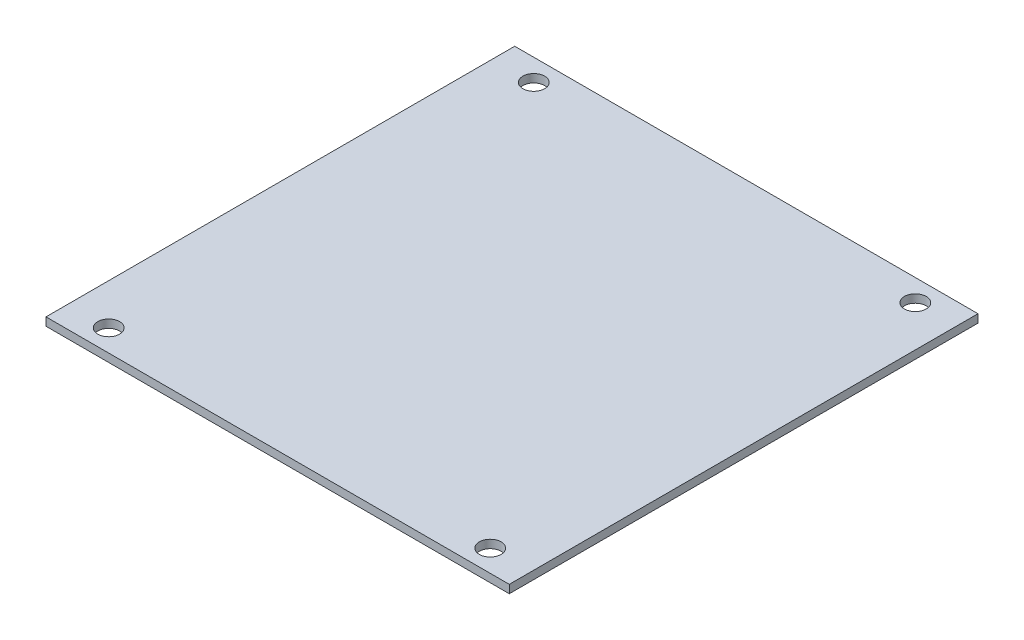
ISO-10303-21;
HEADER;
FILE_DESCRIPTION(('STEP AP214'),'2;1');
FILE_NAME('part.step','',(''),(''),'','','');
FILE_SCHEMA(('AUTOMOTIVE_DESIGN { 1 0 10303 214 1 1 1 1 }'));
ENDSEC;
DATA;
#1=APPLICATION_CONTEXT('core data for automotive mechanical design processes');
#2=APPLICATION_PROTOCOL_DEFINITION('international standard','automotive_design',2000,#1);
#3=PRODUCT_CONTEXT('',#1,'mechanical');
#4=PRODUCT('Part','Part','',(#3));
#5=PRODUCT_RELATED_PRODUCT_CATEGORY('part','',(#4));
#6=PRODUCT_DEFINITION_FORMATION('','',#4);
#7=PRODUCT_DEFINITION_CONTEXT('part definition',#1,'design');
#8=PRODUCT_DEFINITION('design','',#6,#7);
#9=PRODUCT_DEFINITION_SHAPE('','',#8);
#10=(LENGTH_UNIT() NAMED_UNIT(*) SI_UNIT(.MILLI.,.METRE.));
#11=(NAMED_UNIT(*) PLANE_ANGLE_UNIT() SI_UNIT($,.RADIAN.));
#12=(NAMED_UNIT(*) SI_UNIT($,.STERADIAN.) SOLID_ANGLE_UNIT());
#13=UNCERTAINTY_MEASURE_WITH_UNIT(LENGTH_MEASURE(1.E-05),#10,'distance_accuracy_value','');
#14=(GEOMETRIC_REPRESENTATION_CONTEXT(3) GLOBAL_UNCERTAINTY_ASSIGNED_CONTEXT((#13)) GLOBAL_UNIT_ASSIGNED_CONTEXT((#10,
#11,#12)) REPRESENTATION_CONTEXT('',''));
#15=CARTESIAN_POINT('',(0.,0.,0.));
#16=DIRECTION('',(0.,0.,1.));
#17=DIRECTION('',(1.,0.,0.));
#18=AXIS2_PLACEMENT_3D('',#15,#16,#17);
#19=CARTESIAN_POINT('',(0.,3.,0.));
#20=DIRECTION('',(0.,-1.,0.));
#21=DIRECTION('',(0.,0.,-1.));
#22=AXIS2_PLACEMENT_3D('',#19,#20,#21);
#23=PLANE('',#22);
#24=DIRECTION('',(0.,0.,-1.));
#25=VECTOR('',#24,1.);
#26=CARTESIAN_POINT('',(85.,3.,86.));
#27=LINE('',#26,#25);
#28=CARTESIAN_POINT('',(85.,3.,86.));
#29=VERTEX_POINT('',#28);
#30=CARTESIAN_POINT('',(85.,3.,-86.));
#31=VERTEX_POINT('',#30);
#32=EDGE_CURVE('E92',#29,#31,#27,.T.);
#33=ORIENTED_EDGE('',*,*,#32,.T.);
#34=DIRECTION('',(-1.,0.,0.));
#35=VECTOR('',#34,1.);
#36=CARTESIAN_POINT('',(-85.,3.,-86.));
#37=LINE('',#36,#35);
#38=CARTESIAN_POINT('',(-85.,3.,-86.));
#39=VERTEX_POINT('',#38);
#40=EDGE_CURVE('E87',#31,#39,#37,.T.);
#41=ORIENTED_EDGE('',*,*,#40,.T.);
#42=DIRECTION('',(0.,0.,1.));
#43=VECTOR('',#42,1.);
#44=CARTESIAN_POINT('',(-85.,3.,86.));
#45=LINE('',#44,#43);
#46=CARTESIAN_POINT('',(-85.,3.,86.));
#47=VERTEX_POINT('',#46);
#48=EDGE_CURVE('E90',#39,#47,#45,.T.);
#49=ORIENTED_EDGE('',*,*,#48,.T.);
#50=DIRECTION('',(1.,0.,0.));
#51=VECTOR('',#50,1.);
#52=CARTESIAN_POINT('',(-85.,3.,86.));
#53=LINE('',#52,#51);
#54=EDGE_CURVE('E57',#47,#29,#53,.T.);
#55=ORIENTED_EDGE('',*,*,#54,.T.);
#56=EDGE_LOOP('',(#33,#41,#49,#55));
#57=FACE_BOUND('',#56,.T.);
#58=CARTESIAN_POINT('',(-70.,3.,-78.));
#59=DIRECTION('',(0.,1.,0.));
#60=DIRECTION('',(0.,0.,1.));
#61=AXIS2_PLACEMENT_3D('',#58,#59,#60);
#62=CIRCLE('',#61,4.00000000000001);
#63=CARTESIAN_POINT('',(-70.,3.,-74.));
#64=VERTEX_POINT('',#63);
#65=EDGE_CURVE('E112',#64,#64,#62,.T.);
#66=ORIENTED_EDGE('',*,*,#65,.F.);
#67=EDGE_LOOP('',(#66));
#68=FACE_BOUND('',#67,.T.);
#69=CARTESIAN_POINT('',(70.,3.,-78.));
#70=DIRECTION('',(0.,1.,0.));
#71=DIRECTION('',(0.,0.,-1.));
#72=AXIS2_PLACEMENT_3D('',#69,#70,#71);
#73=CIRCLE('',#72,4.00000000000001);
#74=CARTESIAN_POINT('',(70.,3.,-82.));
#75=VERTEX_POINT('',#74);
#76=EDGE_CURVE('E134',#75,#75,#73,.T.);
#77=ORIENTED_EDGE('',*,*,#76,.F.);
#78=EDGE_LOOP('',(#77));
#79=FACE_BOUND('',#78,.T.);
#80=CARTESIAN_POINT('',(70.,3.,78.));
#81=DIRECTION('',(0.,1.,0.));
#82=DIRECTION('',(0.,0.,1.));
#83=AXIS2_PLACEMENT_3D('',#80,#81,#82);
#84=CIRCLE('',#83,4.00000000000001);
#85=CARTESIAN_POINT('',(70.,3.,82.));
#86=VERTEX_POINT('',#85);
#87=EDGE_CURVE('E142',#86,#86,#84,.T.);
#88=ORIENTED_EDGE('',*,*,#87,.F.);
#89=EDGE_LOOP('',(#88));
#90=FACE_BOUND('',#89,.T.);
#91=CARTESIAN_POINT('',(-70.,3.,78.));
#92=DIRECTION('',(0.,1.,0.));
#93=DIRECTION('',(0.,0.,-1.));
#94=AXIS2_PLACEMENT_3D('',#91,#92,#93);
#95=CIRCLE('',#94,4.00000000000001);
#96=CARTESIAN_POINT('',(-70.,3.,74.));
#97=VERTEX_POINT('',#96);
#98=EDGE_CURVE('E150',#97,#97,#95,.T.);
#99=ORIENTED_EDGE('',*,*,#98,.F.);
#100=EDGE_LOOP('',(#99));
#101=FACE_BOUND('',#100,.T.);
#102=ADVANCED_FACE('F39',(#57,#68,#79,#90,#101),#23,.F.);
#103=CARTESIAN_POINT('',(0.,0.,0.));
#104=DIRECTION('',(0.,-1.,0.));
#105=DIRECTION('',(0.,0.,-1.));
#106=AXIS2_PLACEMENT_3D('',#103,#104,#105);
#107=PLANE('',#106);
#108=CARTESIAN_POINT('',(70.,0.,78.));
#109=DIRECTION('',(0.,1.,0.));
#110=DIRECTION('',(0.,0.,1.));
#111=AXIS2_PLACEMENT_3D('',#108,#109,#110);
#112=CIRCLE('',#111,4.00000000000001);
#113=CARTESIAN_POINT('',(70.,0.,82.));
#114=VERTEX_POINT('',#113);
#115=EDGE_CURVE('E146',#114,#114,#112,.T.);
#116=ORIENTED_EDGE('',*,*,#115,.T.);
#117=EDGE_LOOP('',(#116));
#118=FACE_BOUND('',#117,.T.);
#119=CARTESIAN_POINT('',(-70.,0.,-78.));
#120=DIRECTION('',(0.,1.,0.));
#121=DIRECTION('',(0.,0.,1.));
#122=AXIS2_PLACEMENT_3D('',#119,#120,#121);
#123=CIRCLE('',#122,4.00000000000001);
#124=CARTESIAN_POINT('',(-70.,0.,-74.));
#125=VERTEX_POINT('',#124);
#126=EDGE_CURVE('E130',#125,#125,#123,.T.);
#127=ORIENTED_EDGE('',*,*,#126,.T.);
#128=EDGE_LOOP('',(#127));
#129=FACE_BOUND('',#128,.T.);
#130=DIRECTION('',(0.,0.,-1.));
#131=VECTOR('',#130,1.);
#132=CARTESIAN_POINT('',(85.,0.,86.));
#133=LINE('',#132,#131);
#134=CARTESIAN_POINT('',(85.,0.,86.));
#135=VERTEX_POINT('',#134);
#136=CARTESIAN_POINT('',(85.,0.,-86.));
#137=VERTEX_POINT('',#136);
#138=EDGE_CURVE('E108',#135,#137,#133,.T.);
#139=ORIENTED_EDGE('',*,*,#138,.F.);
#140=DIRECTION('',(1.,0.,0.));
#141=VECTOR('',#140,1.);
#142=CARTESIAN_POINT('',(-85.,0.,86.));
#143=LINE('',#142,#141);
#144=CARTESIAN_POINT('',(-85.,0.,86.));
#145=VERTEX_POINT('',#144);
#146=EDGE_CURVE('E80',#145,#135,#143,.T.);
#147=ORIENTED_EDGE('',*,*,#146,.F.);
#148=DIRECTION('',(0.,0.,1.));
#149=VECTOR('',#148,1.);
#150=CARTESIAN_POINT('',(-85.,0.,86.));
#151=LINE('',#150,#149);
#152=CARTESIAN_POINT('',(-85.,0.,-86.));
#153=VERTEX_POINT('',#152);
#154=EDGE_CURVE('E74',#153,#145,#151,.T.);
#155=ORIENTED_EDGE('',*,*,#154,.F.);
#156=DIRECTION('',(-1.,0.,0.));
#157=VECTOR('',#156,1.);
#158=CARTESIAN_POINT('',(-85.,0.,-86.));
#159=LINE('',#158,#157);
#160=EDGE_CURVE('E97',#137,#153,#159,.T.);
#161=ORIENTED_EDGE('',*,*,#160,.F.);
#162=EDGE_LOOP('',(#139,#147,#155,#161));
#163=FACE_BOUND('',#162,.T.);
#164=CARTESIAN_POINT('',(70.,0.,-78.));
#165=DIRECTION('',(0.,1.,0.));
#166=DIRECTION('',(0.,0.,-1.));
#167=AXIS2_PLACEMENT_3D('',#164,#165,#166);
#168=CIRCLE('',#167,4.00000000000001);
#169=CARTESIAN_POINT('',(70.,0.,-82.));
#170=VERTEX_POINT('',#169);
#171=EDGE_CURVE('E138',#170,#170,#168,.T.);
#172=ORIENTED_EDGE('',*,*,#171,.T.);
#173=EDGE_LOOP('',(#172));
#174=FACE_BOUND('',#173,.T.);
#175=CARTESIAN_POINT('',(-70.,0.,78.));
#176=DIRECTION('',(0.,1.,0.));
#177=DIRECTION('',(0.,0.,-1.));
#178=AXIS2_PLACEMENT_3D('',#175,#176,#177);
#179=CIRCLE('',#178,4.00000000000001);
#180=CARTESIAN_POINT('',(-70.,0.,74.));
#181=VERTEX_POINT('',#180);
#182=EDGE_CURVE('E154',#181,#181,#179,.T.);
#183=ORIENTED_EDGE('',*,*,#182,.T.);
#184=EDGE_LOOP('',(#183));
#185=FACE_BOUND('',#184,.T.);
#186=ADVANCED_FACE('F125',(#118,#129,#163,#174,#185),#107,.T.);
#187=CARTESIAN_POINT('',(85.,3.,86.));
#188=DIRECTION('',(-1.,0.,0.));
#189=DIRECTION('',(0.,0.,1.));
#190=AXIS2_PLACEMENT_3D('',#187,#188,#189);
#191=PLANE('',#190);
#192=ORIENTED_EDGE('',*,*,#138,.T.);
#193=DIRECTION('',(0.,-1.,0.));
#194=VECTOR('',#193,1.);
#195=CARTESIAN_POINT('',(85.,3.,-86.));
#196=LINE('',#195,#194);
#197=EDGE_CURVE('E11',#31,#137,#196,.T.);
#198=ORIENTED_EDGE('',*,*,#197,.F.);
#199=ORIENTED_EDGE('',*,*,#32,.F.);
#200=DIRECTION('',(0.,-1.,0.));
#201=VECTOR('',#200,1.);
#202=CARTESIAN_POINT('',(85.,3.,86.));
#203=LINE('',#202,#201);
#204=EDGE_CURVE('E104',#29,#135,#203,.T.);
#205=ORIENTED_EDGE('',*,*,#204,.T.);
#206=EDGE_LOOP('',(#192,#198,#199,#205));
#207=FACE_BOUND('',#206,.T.);
#208=ADVANCED_FACE('F41',(#207),#191,.F.);
#209=CARTESIAN_POINT('',(-85.,3.,-86.));
#210=DIRECTION('',(0.,0.,1.));
#211=DIRECTION('',(1.,0.,0.));
#212=AXIS2_PLACEMENT_3D('',#209,#210,#211);
#213=PLANE('',#212);
#214=ORIENTED_EDGE('',*,*,#160,.T.);
#215=DIRECTION('',(0.,-1.,0.));
#216=VECTOR('',#215,1.);
#217=CARTESIAN_POINT('',(-85.,3.,-86.));
#218=LINE('',#217,#216);
#219=EDGE_CURVE('E49',#39,#153,#218,.T.);
#220=ORIENTED_EDGE('',*,*,#219,.F.);
#221=ORIENTED_EDGE('',*,*,#40,.F.);
#222=ORIENTED_EDGE('',*,*,#197,.T.);
#223=EDGE_LOOP('',(#214,#220,#221,#222));
#224=FACE_BOUND('',#223,.T.);
#225=ADVANCED_FACE('F96',(#224),#213,.F.);
#226=CARTESIAN_POINT('',(-85.,3.,86.));
#227=DIRECTION('',(1.,0.,0.));
#228=DIRECTION('',(0.,0.,-1.));
#229=AXIS2_PLACEMENT_3D('',#226,#227,#228);
#230=PLANE('',#229);
#231=ORIENTED_EDGE('',*,*,#154,.T.);
#232=DIRECTION('',(0.,-1.,0.));
#233=VECTOR('',#232,1.);
#234=CARTESIAN_POINT('',(-85.,3.,86.));
#235=LINE('',#234,#233);
#236=EDGE_CURVE('E99',#47,#145,#235,.T.);
#237=ORIENTED_EDGE('',*,*,#236,.F.);
#238=ORIENTED_EDGE('',*,*,#48,.F.);
#239=ORIENTED_EDGE('',*,*,#219,.T.);
#240=EDGE_LOOP('',(#231,#237,#238,#239));
#241=FACE_BOUND('',#240,.T.);
#242=ADVANCED_FACE('F100',(#241),#230,.F.);
#243=CARTESIAN_POINT('',(-85.,3.,86.));
#244=DIRECTION('',(0.,0.,-1.));
#245=DIRECTION('',(-1.,0.,0.));
#246=AXIS2_PLACEMENT_3D('',#243,#244,#245);
#247=PLANE('',#246);
#248=ORIENTED_EDGE('',*,*,#146,.T.);
#249=ORIENTED_EDGE('',*,*,#204,.F.);
#250=ORIENTED_EDGE('',*,*,#54,.F.);
#251=ORIENTED_EDGE('',*,*,#236,.T.);
#252=EDGE_LOOP('',(#248,#249,#250,#251));
#253=FACE_BOUND('',#252,.T.);
#254=ADVANCED_FACE('F122',(#253),#247,.F.);
#255=CARTESIAN_POINT('',(-70.,3.,-78.));
#256=DIRECTION('',(0.,-1.,0.));
#257=DIRECTION('',(0.,0.,-1.));
#258=AXIS2_PLACEMENT_3D('',#255,#256,#257);
#259=CYLINDRICAL_SURFACE('',#258,4.00000000000001);
#260=ORIENTED_EDGE('',*,*,#65,.T.);
#261=EDGE_LOOP('',(#260));
#262=FACE_BOUND('',#261,.T.);
#263=ORIENTED_EDGE('',*,*,#126,.F.);
#264=EDGE_LOOP('',(#263));
#265=FACE_BOUND('',#264,.T.);
#266=ADVANCED_FACE('F173',(#262,#265),#259,.F.);
#267=CARTESIAN_POINT('',(70.,3.,-78.));
#268=DIRECTION('',(0.,-1.,0.));
#269=DIRECTION('',(0.,0.,-1.));
#270=AXIS2_PLACEMENT_3D('',#267,#268,#269);
#271=CYLINDRICAL_SURFACE('',#270,4.00000000000001);
#272=ORIENTED_EDGE('',*,*,#76,.T.);
#273=EDGE_LOOP('',(#272));
#274=FACE_BOUND('',#273,.T.);
#275=ORIENTED_EDGE('',*,*,#171,.F.);
#276=EDGE_LOOP('',(#275));
#277=FACE_BOUND('',#276,.T.);
#278=ADVANCED_FACE('F219',(#274,#277),#271,.F.);
#279=CARTESIAN_POINT('',(70.,3.,78.));
#280=DIRECTION('',(0.,-1.,0.));
#281=DIRECTION('',(0.,0.,-1.));
#282=AXIS2_PLACEMENT_3D('',#279,#280,#281);
#283=CYLINDRICAL_SURFACE('',#282,4.00000000000001);
#284=ORIENTED_EDGE('',*,*,#87,.T.);
#285=EDGE_LOOP('',(#284));
#286=FACE_BOUND('',#285,.T.);
#287=ORIENTED_EDGE('',*,*,#115,.F.);
#288=EDGE_LOOP('',(#287));
#289=FACE_BOUND('',#288,.T.);
#290=ADVANCED_FACE('F227',(#286,#289),#283,.F.);
#291=CARTESIAN_POINT('',(-70.,3.,78.));
#292=DIRECTION('',(0.,-1.,0.));
#293=DIRECTION('',(0.,0.,-1.));
#294=AXIS2_PLACEMENT_3D('',#291,#292,#293);
#295=CYLINDRICAL_SURFACE('',#294,4.00000000000001);
#296=ORIENTED_EDGE('',*,*,#98,.T.);
#297=EDGE_LOOP('',(#296));
#298=FACE_BOUND('',#297,.T.);
#299=ORIENTED_EDGE('',*,*,#182,.F.);
#300=EDGE_LOOP('',(#299));
#301=FACE_BOUND('',#300,.T.);
#302=ADVANCED_FACE('F162',(#298,#301),#295,.F.);
#303=CLOSED_SHELL('',(#102,#186,#208,#225,#242,#254,#266,#278,#290,#302));
#304=MANIFOLD_SOLID_BREP('B2',#303);
#305=ADVANCED_BREP_SHAPE_REPRESENTATION('',(#18,#304),#14);
#306=SHAPE_DEFINITION_REPRESENTATION(#9,#305);
ENDSEC;
END-ISO-10303-21;
